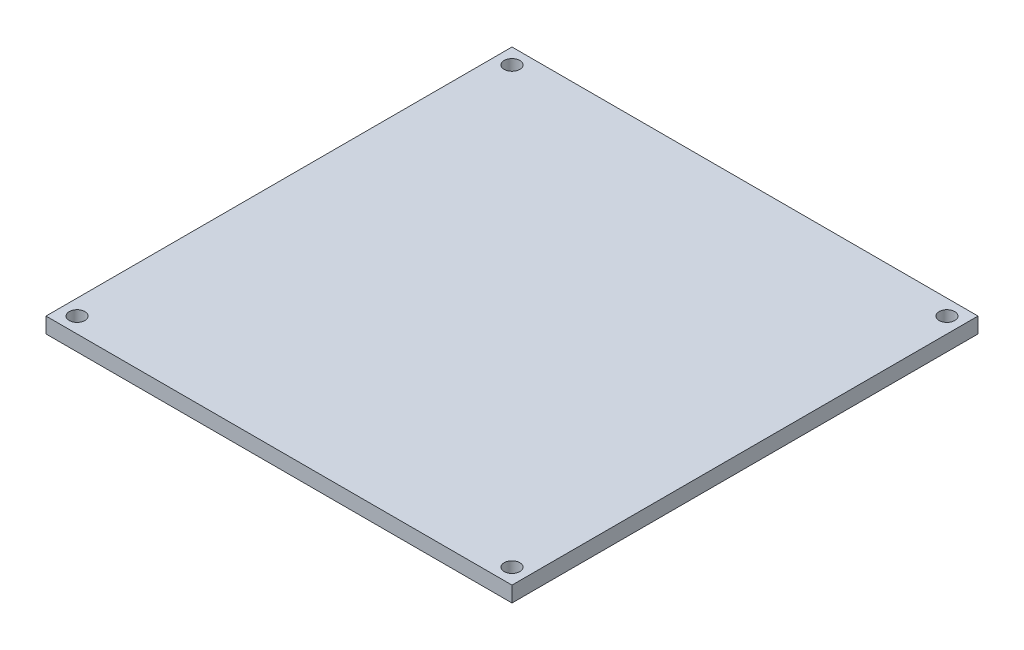
ISO-10303-21;
HEADER;
FILE_DESCRIPTION(('STEP AP214'),'2;1');
FILE_NAME('part.step','',(''),(''),'','','');
FILE_SCHEMA(('AUTOMOTIVE_DESIGN { 1 0 10303 214 1 1 1 1 }'));
ENDSEC;
DATA;
#1=APPLICATION_CONTEXT('core data for automotive mechanical design processes');
#2=APPLICATION_PROTOCOL_DEFINITION('international standard','automotive_design',2000,#1);
#3=PRODUCT_CONTEXT('',#1,'mechanical');
#4=PRODUCT('Part','Part','',(#3));
#5=PRODUCT_RELATED_PRODUCT_CATEGORY('part','',(#4));
#6=PRODUCT_DEFINITION_FORMATION('','',#4);
#7=PRODUCT_DEFINITION_CONTEXT('part definition',#1,'design');
#8=PRODUCT_DEFINITION('design','',#6,#7);
#9=PRODUCT_DEFINITION_SHAPE('','',#8);
#10=(LENGTH_UNIT() NAMED_UNIT(*) SI_UNIT(.MILLI.,.METRE.));
#11=(NAMED_UNIT(*) PLANE_ANGLE_UNIT() SI_UNIT($,.RADIAN.));
#12=(NAMED_UNIT(*) SI_UNIT($,.STERADIAN.) SOLID_ANGLE_UNIT());
#13=UNCERTAINTY_MEASURE_WITH_UNIT(LENGTH_MEASURE(1.E-05),#10,'distance_accuracy_value','');
#14=(GEOMETRIC_REPRESENTATION_CONTEXT(3) GLOBAL_UNCERTAINTY_ASSIGNED_CONTEXT((#13)) GLOBAL_UNIT_ASSIGNED_CONTEXT((#10,
#11,#12)) REPRESENTATION_CONTEXT('',''));
#15=CARTESIAN_POINT('',(0.,0.,0.));
#16=DIRECTION('',(0.,0.,1.));
#17=DIRECTION('',(1.,0.,0.));
#18=AXIS2_PLACEMENT_3D('',#15,#16,#17);
#19=CARTESIAN_POINT('',(0.,1.5,0.));
#20=DIRECTION('',(0.,-1.,0.));
#21=DIRECTION('',(0.,0.,-1.));
#22=AXIS2_PLACEMENT_3D('',#19,#20,#21);
#23=PLANE('',#22);
#24=DIRECTION('',(0.,0.,1.));
#25=VECTOR('',#24,1.);
#26=CARTESIAN_POINT('',(0.,1.5,0.));
#27=LINE('',#26,#25);
#28=CARTESIAN_POINT('',(0.,1.5,-45.));
#29=VERTEX_POINT('',#28);
#30=CARTESIAN_POINT('',(0.,1.5,0.));
#31=VERTEX_POINT('',#30);
#32=EDGE_CURVE('E87',#29,#31,#27,.T.);
#33=ORIENTED_EDGE('',*,*,#32,.T.);
#34=DIRECTION('',(1.,0.,0.));
#35=VECTOR('',#34,1.);
#36=CARTESIAN_POINT('',(0.,1.5,0.));
#37=LINE('',#36,#35);
#38=CARTESIAN_POINT('',(45.,1.5,0.));
#39=VERTEX_POINT('',#38);
#40=EDGE_CURVE('E82',#31,#39,#37,.T.);
#41=ORIENTED_EDGE('',*,*,#40,.T.);
#42=DIRECTION('',(0.,0.,-1.));
#43=VECTOR('',#42,1.);
#44=CARTESIAN_POINT('',(45.,1.5,0.));
#45=LINE('',#44,#43);
#46=CARTESIAN_POINT('',(45.,1.5,-45.));
#47=VERTEX_POINT('',#46);
#48=EDGE_CURVE('E85',#39,#47,#45,.T.);
#49=ORIENTED_EDGE('',*,*,#48,.T.);
#50=DIRECTION('',(-1.,0.,0.));
#51=VECTOR('',#50,1.);
#52=CARTESIAN_POINT('',(0.,1.5,-45.));
#53=LINE('',#52,#51);
#54=EDGE_CURVE('E52',#47,#29,#53,.T.);
#55=ORIENTED_EDGE('',*,*,#54,.T.);
#56=EDGE_LOOP('',(#33,#41,#49,#55));
#57=FACE_BOUND('',#56,.T.);
#58=CARTESIAN_POINT('',(1.5,1.5,-1.49999999999999));
#59=DIRECTION('',(0.,1.,0.));
#60=DIRECTION('',(0.,0.,1.));
#61=AXIS2_PLACEMENT_3D('',#58,#59,#60);
#62=CIRCLE('',#61,0.754054512091463);
#63=CARTESIAN_POINT('',(1.5,1.5,-0.745945487908531));
#64=VERTEX_POINT('',#63);
#65=EDGE_CURVE('E102',#64,#64,#62,.T.);
#66=ORIENTED_EDGE('',*,*,#65,.F.);
#67=EDGE_LOOP('',(#66));
#68=FACE_BOUND('',#67,.T.);
#69=CARTESIAN_POINT('',(1.49999999999999,1.5,-43.5));
#70=DIRECTION('',(0.,1.,0.));
#71=DIRECTION('',(0.,0.,1.));
#72=AXIS2_PLACEMENT_3D('',#69,#70,#71);
#73=CIRCLE('',#72,0.754054512091465);
#74=CARTESIAN_POINT('',(1.49999999999999,1.5,-42.7459454879085));
#75=VERTEX_POINT('',#74);
#76=EDGE_CURVE('E117',#75,#75,#73,.T.);
#77=ORIENTED_EDGE('',*,*,#76,.F.);
#78=EDGE_LOOP('',(#77));
#79=FACE_BOUND('',#78,.T.);
#80=CARTESIAN_POINT('',(43.5,1.5,-43.5));
#81=DIRECTION('',(0.,1.,0.));
#82=DIRECTION('',(0.,0.,1.));
#83=AXIS2_PLACEMENT_3D('',#80,#81,#82);
#84=CIRCLE('',#83,0.754054512091464);
#85=CARTESIAN_POINT('',(43.5,1.5,-42.7459454879085));
#86=VERTEX_POINT('',#85);
#87=EDGE_CURVE('E123',#86,#86,#84,.T.);
#88=ORIENTED_EDGE('',*,*,#87,.F.);
#89=EDGE_LOOP('',(#88));
#90=FACE_BOUND('',#89,.T.);
#91=CARTESIAN_POINT('',(43.5,1.5,-1.49999999999999));
#92=DIRECTION('',(0.,1.,0.));
#93=DIRECTION('',(0.,0.,1.));
#94=AXIS2_PLACEMENT_3D('',#91,#92,#93);
#95=CIRCLE('',#94,0.754054512091464);
#96=CARTESIAN_POINT('',(43.5,1.5,-0.74594548790853));
#97=VERTEX_POINT('',#96);
#98=EDGE_CURVE('E129',#97,#97,#95,.T.);
#99=ORIENTED_EDGE('',*,*,#98,.F.);
#100=EDGE_LOOP('',(#99));
#101=FACE_BOUND('',#100,.T.);
#102=ADVANCED_FACE('F35',(#57,#68,#79,#90,#101),#23,.F.);
#103=CARTESIAN_POINT('',(0.,0.,0.));
#104=DIRECTION('',(0.,-1.,0.));
#105=DIRECTION('',(0.,0.,-1.));
#106=AXIS2_PLACEMENT_3D('',#103,#104,#105);
#107=PLANE('',#106);
#108=CARTESIAN_POINT('',(43.5,0.,-43.5));
#109=DIRECTION('',(0.,1.,0.));
#110=DIRECTION('',(0.,0.,1.));
#111=AXIS2_PLACEMENT_3D('',#108,#109,#110);
#112=CIRCLE('',#111,0.754054512091464);
#113=CARTESIAN_POINT('',(43.5,0.,-42.7459454879085));
#114=VERTEX_POINT('',#113);
#115=EDGE_CURVE('E126',#114,#114,#112,.T.);
#116=ORIENTED_EDGE('',*,*,#115,.T.);
#117=EDGE_LOOP('',(#116));
#118=FACE_BOUND('',#117,.T.);
#119=CARTESIAN_POINT('',(1.5,0.,-1.49999999999999));
#120=DIRECTION('',(0.,1.,0.));
#121=DIRECTION('',(0.,0.,1.));
#122=AXIS2_PLACEMENT_3D('',#119,#120,#121);
#123=CIRCLE('',#122,0.754054512091463);
#124=CARTESIAN_POINT('',(1.5,0.,-0.745945487908531));
#125=VERTEX_POINT('',#124);
#126=EDGE_CURVE('E114',#125,#125,#123,.T.);
#127=ORIENTED_EDGE('',*,*,#126,.T.);
#128=EDGE_LOOP('',(#127));
#129=FACE_BOUND('',#128,.T.);
#130=DIRECTION('',(0.,0.,1.));
#131=VECTOR('',#130,1.);
#132=CARTESIAN_POINT('',(0.,0.,0.));
#133=LINE('',#132,#131);
#134=CARTESIAN_POINT('',(0.,0.,-45.));
#135=VERTEX_POINT('',#134);
#136=CARTESIAN_POINT('',(0.,0.,0.));
#137=VERTEX_POINT('',#136);
#138=EDGE_CURVE('E99',#135,#137,#133,.T.);
#139=ORIENTED_EDGE('',*,*,#138,.F.);
#140=DIRECTION('',(-1.,0.,0.));
#141=VECTOR('',#140,1.);
#142=CARTESIAN_POINT('',(0.,0.,-45.));
#143=LINE('',#142,#141);
#144=CARTESIAN_POINT('',(45.,0.,-45.));
#145=VERTEX_POINT('',#144);
#146=EDGE_CURVE('E75',#145,#135,#143,.T.);
#147=ORIENTED_EDGE('',*,*,#146,.F.);
#148=DIRECTION('',(0.,0.,-1.));
#149=VECTOR('',#148,1.);
#150=CARTESIAN_POINT('',(45.,0.,0.));
#151=LINE('',#150,#149);
#152=CARTESIAN_POINT('',(45.,0.,0.));
#153=VERTEX_POINT('',#152);
#154=EDGE_CURVE('E69',#153,#145,#151,.T.);
#155=ORIENTED_EDGE('',*,*,#154,.F.);
#156=DIRECTION('',(1.,0.,0.));
#157=VECTOR('',#156,1.);
#158=CARTESIAN_POINT('',(0.,0.,0.));
#159=LINE('',#158,#157);
#160=EDGE_CURVE('E91',#137,#153,#159,.T.);
#161=ORIENTED_EDGE('',*,*,#160,.F.);
#162=EDGE_LOOP('',(#139,#147,#155,#161));
#163=FACE_BOUND('',#162,.T.);
#164=CARTESIAN_POINT('',(1.49999999999999,0.,-43.5));
#165=DIRECTION('',(0.,1.,0.));
#166=DIRECTION('',(0.,0.,1.));
#167=AXIS2_PLACEMENT_3D('',#164,#165,#166);
#168=CIRCLE('',#167,0.754054512091465);
#169=CARTESIAN_POINT('',(1.49999999999999,0.,-42.7459454879085));
#170=VERTEX_POINT('',#169);
#171=EDGE_CURVE('E120',#170,#170,#168,.T.);
#172=ORIENTED_EDGE('',*,*,#171,.T.);
#173=EDGE_LOOP('',(#172));
#174=FACE_BOUND('',#173,.T.);
#175=CARTESIAN_POINT('',(43.5,0.,-1.49999999999999));
#176=DIRECTION('',(0.,1.,0.));
#177=DIRECTION('',(0.,0.,1.));
#178=AXIS2_PLACEMENT_3D('',#175,#176,#177);
#179=CIRCLE('',#178,0.754054512091464);
#180=CARTESIAN_POINT('',(43.5,0.,-0.74594548790853));
#181=VERTEX_POINT('',#180);
#182=EDGE_CURVE('E132',#181,#181,#179,.T.);
#183=ORIENTED_EDGE('',*,*,#182,.T.);
#184=EDGE_LOOP('',(#183));
#185=FACE_BOUND('',#184,.T.);
#186=ADVANCED_FACE('F110',(#118,#129,#163,#174,#185),#107,.T.);
#187=CARTESIAN_POINT('',(0.,1.5,0.));
#188=DIRECTION('',(1.,0.,0.));
#189=DIRECTION('',(0.,0.,-1.));
#190=AXIS2_PLACEMENT_3D('',#187,#188,#189);
#191=PLANE('',#190);
#192=ORIENTED_EDGE('',*,*,#138,.T.);
#193=DIRECTION('',(0.,-1.,0.));
#194=VECTOR('',#193,1.);
#195=CARTESIAN_POINT('',(0.,1.5,0.));
#196=LINE('',#195,#194);
#197=EDGE_CURVE('E11',#31,#137,#196,.T.);
#198=ORIENTED_EDGE('',*,*,#197,.F.);
#199=ORIENTED_EDGE('',*,*,#32,.F.);
#200=DIRECTION('',(0.,-1.,0.));
#201=VECTOR('',#200,1.);
#202=CARTESIAN_POINT('',(0.,1.5,-45.));
#203=LINE('',#202,#201);
#204=EDGE_CURVE('E95',#29,#135,#203,.T.);
#205=ORIENTED_EDGE('',*,*,#204,.T.);
#206=EDGE_LOOP('',(#192,#198,#199,#205));
#207=FACE_BOUND('',#206,.T.);
#208=ADVANCED_FACE('F37',(#207),#191,.F.);
#209=CARTESIAN_POINT('',(0.,1.5,0.));
#210=DIRECTION('',(0.,0.,-1.));
#211=DIRECTION('',(-1.,0.,0.));
#212=AXIS2_PLACEMENT_3D('',#209,#210,#211);
#213=PLANE('',#212);
#214=ORIENTED_EDGE('',*,*,#160,.T.);
#215=DIRECTION('',(0.,-1.,0.));
#216=VECTOR('',#215,1.);
#217=CARTESIAN_POINT('',(45.,1.5,0.));
#218=LINE('',#217,#216);
#219=EDGE_CURVE('E44',#39,#153,#218,.T.);
#220=ORIENTED_EDGE('',*,*,#219,.F.);
#221=ORIENTED_EDGE('',*,*,#40,.F.);
#222=ORIENTED_EDGE('',*,*,#197,.T.);
#223=EDGE_LOOP('',(#214,#220,#221,#222));
#224=FACE_BOUND('',#223,.T.);
#225=ADVANCED_FACE('F90',(#224),#213,.F.);
#226=CARTESIAN_POINT('',(45.,1.5,0.));
#227=DIRECTION('',(-1.,0.,0.));
#228=DIRECTION('',(0.,0.,1.));
#229=AXIS2_PLACEMENT_3D('',#226,#227,#228);
#230=PLANE('',#229);
#231=ORIENTED_EDGE('',*,*,#154,.T.);
#232=DIRECTION('',(0.,-1.,0.));
#233=VECTOR('',#232,1.);
#234=CARTESIAN_POINT('',(45.,1.5,-45.));
#235=LINE('',#234,#233);
#236=EDGE_CURVE('E92',#47,#145,#235,.T.);
#237=ORIENTED_EDGE('',*,*,#236,.F.);
#238=ORIENTED_EDGE('',*,*,#48,.F.);
#239=ORIENTED_EDGE('',*,*,#219,.T.);
#240=EDGE_LOOP('',(#231,#237,#238,#239));
#241=FACE_BOUND('',#240,.T.);
#242=ADVANCED_FACE('F93',(#241),#230,.F.);
#243=CARTESIAN_POINT('',(0.,1.5,-45.));
#244=DIRECTION('',(0.,0.,1.));
#245=DIRECTION('',(1.,0.,0.));
#246=AXIS2_PLACEMENT_3D('',#243,#244,#245);
#247=PLANE('',#246);
#248=ORIENTED_EDGE('',*,*,#146,.T.);
#249=ORIENTED_EDGE('',*,*,#204,.F.);
#250=ORIENTED_EDGE('',*,*,#54,.F.);
#251=ORIENTED_EDGE('',*,*,#236,.T.);
#252=EDGE_LOOP('',(#248,#249,#250,#251));
#253=FACE_BOUND('',#252,.T.);
#254=ADVANCED_FACE('F107',(#253),#247,.F.);
#255=CARTESIAN_POINT('',(1.5,1.5,-1.49999999999999));
#256=DIRECTION('',(0.,-1.,0.));
#257=DIRECTION('',(0.,0.,-1.));
#258=AXIS2_PLACEMENT_3D('',#255,#256,#257);
#259=CYLINDRICAL_SURFACE('',#258,0.754054512091463);
#260=ORIENTED_EDGE('',*,*,#65,.T.);
#261=EDGE_LOOP('',(#260));
#262=FACE_BOUND('',#261,.T.);
#263=ORIENTED_EDGE('',*,*,#126,.F.);
#264=EDGE_LOOP('',(#263));
#265=FACE_BOUND('',#264,.T.);
#266=ADVANCED_FACE('F149',(#262,#265),#259,.F.);
#267=CARTESIAN_POINT('',(1.49999999999999,1.5,-43.5));
#268=DIRECTION('',(0.,-1.,0.));
#269=DIRECTION('',(0.,0.,-1.));
#270=AXIS2_PLACEMENT_3D('',#267,#268,#269);
#271=CYLINDRICAL_SURFACE('',#270,0.754054512091465);
#272=ORIENTED_EDGE('',*,*,#76,.T.);
#273=EDGE_LOOP('',(#272));
#274=FACE_BOUND('',#273,.T.);
#275=ORIENTED_EDGE('',*,*,#171,.F.);
#276=EDGE_LOOP('',(#275));
#277=FACE_BOUND('',#276,.T.);
#278=ADVANCED_FACE('F195',(#274,#277),#271,.F.);
#279=CARTESIAN_POINT('',(43.5,1.5,-43.5));
#280=DIRECTION('',(0.,-1.,0.));
#281=DIRECTION('',(0.,0.,-1.));
#282=AXIS2_PLACEMENT_3D('',#279,#280,#281);
#283=CYLINDRICAL_SURFACE('',#282,0.754054512091464);
#284=ORIENTED_EDGE('',*,*,#87,.T.);
#285=EDGE_LOOP('',(#284));
#286=FACE_BOUND('',#285,.T.);
#287=ORIENTED_EDGE('',*,*,#115,.F.);
#288=EDGE_LOOP('',(#287));
#289=FACE_BOUND('',#288,.T.);
#290=ADVANCED_FACE('F203',(#286,#289),#283,.F.);
#291=CARTESIAN_POINT('',(43.5,1.5,-1.49999999999999));
#292=DIRECTION('',(0.,-1.,0.));
#293=DIRECTION('',(0.,0.,-1.));
#294=AXIS2_PLACEMENT_3D('',#291,#292,#293);
#295=CYLINDRICAL_SURFACE('',#294,0.754054512091464);
#296=ORIENTED_EDGE('',*,*,#98,.T.);
#297=EDGE_LOOP('',(#296));
#298=FACE_BOUND('',#297,.T.);
#299=ORIENTED_EDGE('',*,*,#182,.F.);
#300=EDGE_LOOP('',(#299));
#301=FACE_BOUND('',#300,.T.);
#302=ADVANCED_FACE('F138',(#298,#301),#295,.F.);
#303=CLOSED_SHELL('',(#102,#186,#208,#225,#242,#254,#266,#278,#290,#302));
#304=MANIFOLD_SOLID_BREP('B2',#303);
#305=ADVANCED_BREP_SHAPE_REPRESENTATION('',(#18,#304),#14);
#306=SHAPE_DEFINITION_REPRESENTATION(#9,#305);
ENDSEC;
END-ISO-10303-21;
